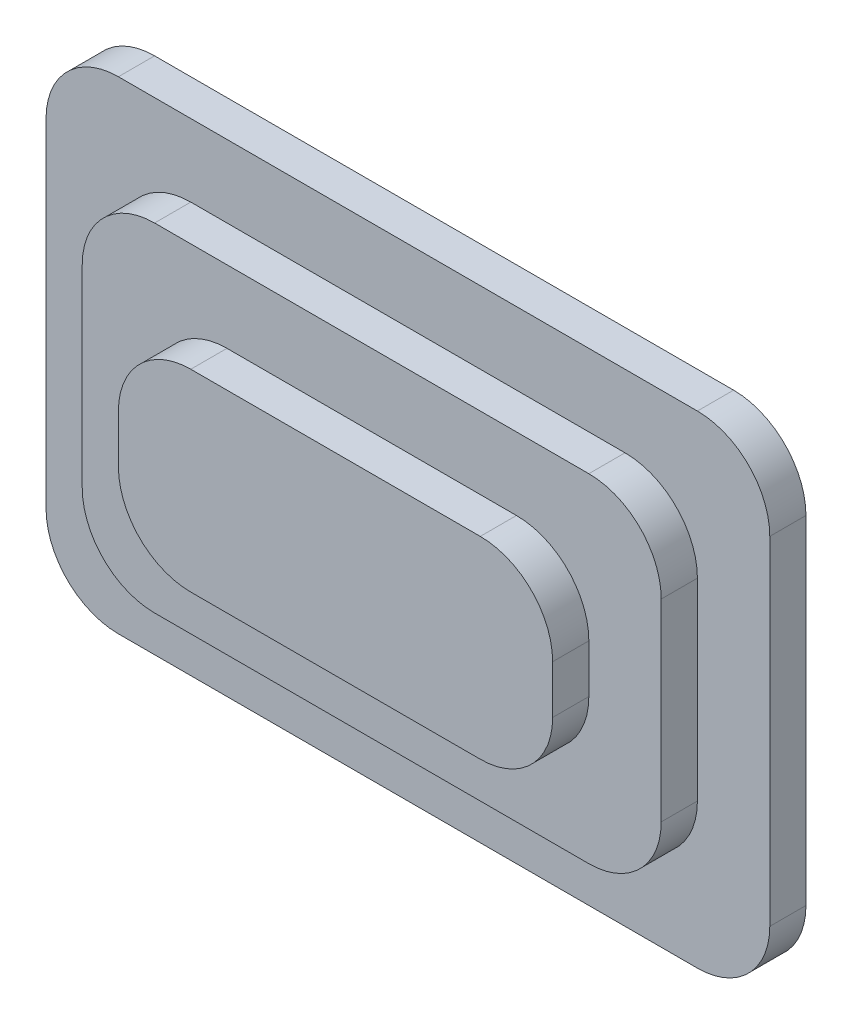
ISO-10303-21;
HEADER;
FILE_DESCRIPTION(('STEP AP214'),'2;1');
FILE_NAME('part.step','',(''),(''),'','','');
FILE_SCHEMA(('AUTOMOTIVE_DESIGN { 1 0 10303 214 1 1 1 1 }'));
ENDSEC;
DATA;
#1=APPLICATION_CONTEXT('core data for automotive mechanical design processes');
#2=APPLICATION_PROTOCOL_DEFINITION('international standard','automotive_design',2000,#1);
#3=PRODUCT_CONTEXT('',#1,'mechanical');
#4=PRODUCT('Part','Part','',(#3));
#5=PRODUCT_RELATED_PRODUCT_CATEGORY('part','',(#4));
#6=PRODUCT_DEFINITION_FORMATION('','',#4);
#7=PRODUCT_DEFINITION_CONTEXT('part definition',#1,'design');
#8=PRODUCT_DEFINITION('design','',#6,#7);
#9=PRODUCT_DEFINITION_SHAPE('','',#8);
#10=(LENGTH_UNIT() NAMED_UNIT(*) SI_UNIT(.MILLI.,.METRE.));
#11=(NAMED_UNIT(*) PLANE_ANGLE_UNIT() SI_UNIT($,.RADIAN.));
#12=(NAMED_UNIT(*) SI_UNIT($,.STERADIAN.) SOLID_ANGLE_UNIT());
#13=UNCERTAINTY_MEASURE_WITH_UNIT(LENGTH_MEASURE(1.E-05),#10,'distance_accuracy_value','');
#14=(GEOMETRIC_REPRESENTATION_CONTEXT(3) GLOBAL_UNCERTAINTY_ASSIGNED_CONTEXT((#13)) GLOBAL_UNIT_ASSIGNED_CONTEXT((#10,
#11,#12)) REPRESENTATION_CONTEXT('',''));
#15=CARTESIAN_POINT('',(0.,0.,0.));
#16=DIRECTION('',(0.,0.,1.));
#17=DIRECTION('',(1.,0.,0.));
#18=AXIS2_PLACEMENT_3D('',#15,#16,#17);
#19=CARTESIAN_POINT('',(375.,250.,13.4583428199529));
#20=DIRECTION('',(-1.,0.,0.));
#21=DIRECTION('',(0.,0.,1.));
#22=AXIS2_PLACEMENT_3D('',#19,#20,#21);
#23=PLANE('',#22);
#24=DIRECTION('',(0.,1.,0.));
#25=VECTOR('',#24,1.);
#26=CARTESIAN_POINT('',(375.,250.,-24.0416571800471));
#27=LINE('',#26,#25);
#28=CARTESIAN_POINT('',(375.,-175.,-24.0416571800471));
#29=VERTEX_POINT('',#28);
#30=CARTESIAN_POINT('',(375.,175.,-24.0416571800471));
#31=VERTEX_POINT('',#30);
#32=EDGE_CURVE('E270',#29,#31,#27,.T.);
#33=ORIENTED_EDGE('',*,*,#32,.T.);
#34=DIRECTION('',(0.,0.,-1.));
#35=VECTOR('',#34,1.);
#36=CARTESIAN_POINT('',(375.,175.,13.4583428199529));
#37=LINE('',#36,#35);
#38=CARTESIAN_POINT('',(375.,175.,13.4583428199529));
#39=VERTEX_POINT('',#38);
#40=EDGE_CURVE('E11',#31,#39,#37,.F.);
#41=ORIENTED_EDGE('',*,*,#40,.T.);
#42=DIRECTION('',(0.,1.,0.));
#43=VECTOR('',#42,1.);
#44=CARTESIAN_POINT('',(375.,250.,13.4583428199529));
#45=LINE('',#44,#43);
#46=CARTESIAN_POINT('',(375.,-175.,13.4583428199529));
#47=VERTEX_POINT('',#46);
#48=EDGE_CURVE('E287',#47,#39,#45,.T.);
#49=ORIENTED_EDGE('',*,*,#48,.F.);
#50=DIRECTION('',(0.,0.,-1.));
#51=VECTOR('',#50,1.);
#52=CARTESIAN_POINT('',(375.,-175.,13.4583428199529));
#53=LINE('',#52,#51);
#54=EDGE_CURVE('E52',#47,#29,#53,.T.);
#55=ORIENTED_EDGE('',*,*,#54,.T.);
#56=EDGE_LOOP('',(#33,#41,#49,#55));
#57=FACE_BOUND('',#56,.T.);
#58=ADVANCED_FACE('F43',(#57),#23,.F.);
#59=CARTESIAN_POINT('',(-375.,250.,13.4583428199529));
#60=DIRECTION('',(0.,-1.,0.));
#61=DIRECTION('',(0.,0.,-1.));
#62=AXIS2_PLACEMENT_3D('',#59,#60,#61);
#63=PLANE('',#62);
#64=DIRECTION('',(-1.,0.,0.));
#65=VECTOR('',#64,1.);
#66=CARTESIAN_POINT('',(-375.,250.,-24.0416571800471));
#67=LINE('',#66,#65);
#68=CARTESIAN_POINT('',(300.,250.,-24.0416571800471));
#69=VERTEX_POINT('',#68);
#70=CARTESIAN_POINT('',(-300.,250.,-24.0416571800471));
#71=VERTEX_POINT('',#70);
#72=EDGE_CURVE('E305',#69,#71,#67,.T.);
#73=ORIENTED_EDGE('',*,*,#72,.T.);
#74=DIRECTION('',(0.,0.,-1.));
#75=VECTOR('',#74,1.);
#76=CARTESIAN_POINT('',(-300.,250.,13.4583428199529));
#77=LINE('',#76,#75);
#78=CARTESIAN_POINT('',(-300.,250.,13.4583428199529));
#79=VERTEX_POINT('',#78);
#80=EDGE_CURVE('E59',#71,#79,#77,.F.);
#81=ORIENTED_EDGE('',*,*,#80,.T.);
#82=DIRECTION('',(-1.,0.,0.));
#83=VECTOR('',#82,1.);
#84=CARTESIAN_POINT('',(-375.,250.,13.4583428199529));
#85=LINE('',#84,#83);
#86=CARTESIAN_POINT('',(300.,250.,13.4583428199529));
#87=VERTEX_POINT('',#86);
#88=EDGE_CURVE('E290',#87,#79,#85,.T.);
#89=ORIENTED_EDGE('',*,*,#88,.F.);
#90=DIRECTION('',(0.,0.,-1.));
#91=VECTOR('',#90,1.);
#92=CARTESIAN_POINT('',(300.,250.,13.4583428199529));
#93=LINE('',#92,#91);
#94=EDGE_CURVE('E441',#87,#69,#93,.T.);
#95=ORIENTED_EDGE('',*,*,#94,.T.);
#96=EDGE_LOOP('',(#73,#81,#89,#95));
#97=FACE_BOUND('',#96,.T.);
#98=ADVANCED_FACE('F463',(#97),#63,.F.);
#99=CARTESIAN_POINT('',(-375.,250.,13.4583428199529));
#100=DIRECTION('',(1.,0.,0.));
#101=DIRECTION('',(0.,1.,0.));
#102=AXIS2_PLACEMENT_3D('',#99,#100,#101);
#103=PLANE('',#102);
#104=DIRECTION('',(0.,-1.,0.));
#105=VECTOR('',#104,1.);
#106=CARTESIAN_POINT('',(-375.,250.,-24.0416571800471));
#107=LINE('',#106,#105);
#108=CARTESIAN_POINT('',(-375.,175.,-24.0416571800471));
#109=VERTEX_POINT('',#108);
#110=CARTESIAN_POINT('',(-375.,-175.,-24.0416571800471));
#111=VERTEX_POINT('',#110);
#112=EDGE_CURVE('E308',#109,#111,#107,.T.);
#113=ORIENTED_EDGE('',*,*,#112,.T.);
#114=DIRECTION('',(0.,0.,-1.));
#115=VECTOR('',#114,1.);
#116=CARTESIAN_POINT('',(-375.,-175.,13.4583428199529));
#117=LINE('',#116,#115);
#118=CARTESIAN_POINT('',(-375.,-175.,13.4583428199529));
#119=VERTEX_POINT('',#118);
#120=EDGE_CURVE('E427',#111,#119,#117,.F.);
#121=ORIENTED_EDGE('',*,*,#120,.T.);
#122=DIRECTION('',(0.,-1.,0.));
#123=VECTOR('',#122,1.);
#124=CARTESIAN_POINT('',(-375.,250.,13.4583428199529));
#125=LINE('',#124,#123);
#126=CARTESIAN_POINT('',(-375.,175.,13.4583428199529));
#127=VERTEX_POINT('',#126);
#128=EDGE_CURVE('E294',#127,#119,#125,.T.);
#129=ORIENTED_EDGE('',*,*,#128,.F.);
#130=DIRECTION('',(0.,0.,-1.));
#131=VECTOR('',#130,1.);
#132=CARTESIAN_POINT('',(-375.,175.,13.4583428199529));
#133=LINE('',#132,#131);
#134=EDGE_CURVE('E423',#127,#109,#133,.T.);
#135=ORIENTED_EDGE('',*,*,#134,.T.);
#136=EDGE_LOOP('',(#113,#121,#129,#135));
#137=FACE_BOUND('',#136,.T.);
#138=ADVANCED_FACE('F472',(#137),#103,.F.);
#139=CARTESIAN_POINT('',(-375.,-250.,13.4583428199529));
#140=DIRECTION('',(0.,1.,0.));
#141=DIRECTION('',(0.,0.,1.));
#142=AXIS2_PLACEMENT_3D('',#139,#140,#141);
#143=PLANE('',#142);
#144=DIRECTION('',(1.,0.,0.));
#145=VECTOR('',#144,1.);
#146=CARTESIAN_POINT('',(-375.,-250.,13.4583428199529));
#147=LINE('',#146,#145);
#148=CARTESIAN_POINT('',(-300.,-250.,13.4583428199529));
#149=VERTEX_POINT('',#148);
#150=CARTESIAN_POINT('',(300.,-250.,13.4583428199529));
#151=VERTEX_POINT('',#150);
#152=EDGE_CURVE('E298',#149,#151,#147,.T.);
#153=ORIENTED_EDGE('',*,*,#152,.F.);
#154=DIRECTION('',(0.,0.,-1.));
#155=VECTOR('',#154,1.);
#156=CARTESIAN_POINT('',(-300.,-250.,13.4583428199529));
#157=LINE('',#156,#155);
#158=CARTESIAN_POINT('',(-300.,-250.,-24.0416571800471));
#159=VERTEX_POINT('',#158);
#160=EDGE_CURVE('E407',#149,#159,#157,.T.);
#161=ORIENTED_EDGE('',*,*,#160,.T.);
#162=DIRECTION('',(1.,0.,0.));
#163=VECTOR('',#162,1.);
#164=CARTESIAN_POINT('',(-375.,-250.,-24.0416571800471));
#165=LINE('',#164,#163);
#166=CARTESIAN_POINT('',(300.,-250.,-24.0416571800471));
#167=VERTEX_POINT('',#166);
#168=EDGE_CURVE('E291',#159,#167,#165,.T.);
#169=ORIENTED_EDGE('',*,*,#168,.T.);
#170=DIRECTION('',(0.,0.,-1.));
#171=VECTOR('',#170,1.);
#172=CARTESIAN_POINT('',(300.,-250.,13.4583428199529));
#173=LINE('',#172,#171);
#174=EDGE_CURVE('E404',#167,#151,#173,.F.);
#175=ORIENTED_EDGE('',*,*,#174,.T.);
#176=EDGE_LOOP('',(#153,#161,#169,#175));
#177=FACE_BOUND('',#176,.T.);
#178=ADVANCED_FACE('F480',(#177),#143,.F.);
#179=CARTESIAN_POINT('',(-3.78685664913888E-13,0.,13.4583428199529));
#180=DIRECTION('',(0.,0.,1.));
#181=DIRECTION('',(1.,0.,0.));
#182=AXIS2_PLACEMENT_3D('',#179,#180,#181);
#183=PLANE('',#182);
#184=DIRECTION('',(0.,-1.,0.));
#185=VECTOR('',#184,1.);
#186=CARTESIAN_POINT('',(-300.,175.,13.4583428199529));
#187=LINE('',#186,#185);
#188=CARTESIAN_POINT('',(-300.,100.,13.4583428199529));
#189=VERTEX_POINT('',#188);
#190=CARTESIAN_POINT('',(-300.,-100.,13.4583428199529));
#191=VERTEX_POINT('',#190);
#192=EDGE_CURVE('E271',#189,#191,#187,.T.);
#193=ORIENTED_EDGE('',*,*,#192,.F.);
#194=CARTESIAN_POINT('',(-225.,100.,13.4583428199529));
#195=DIRECTION('',(0.,0.,1.));
#196=DIRECTION('',(1.,0.,0.));
#197=AXIS2_PLACEMENT_3D('',#194,#195,#196);
#198=CIRCLE('',#197,75.);
#199=CARTESIAN_POINT('',(-225.,175.,13.4583428199529));
#200=VERTEX_POINT('',#199);
#201=EDGE_CURVE('E398',#189,#200,#198,.F.);
#202=ORIENTED_EDGE('',*,*,#201,.T.);
#203=DIRECTION('',(-1.,0.,0.));
#204=VECTOR('',#203,1.);
#205=CARTESIAN_POINT('',(300.,175.,13.4583428199529));
#206=LINE('',#205,#204);
#207=CARTESIAN_POINT('',(225.,175.,13.4583428199529));
#208=VERTEX_POINT('',#207);
#209=EDGE_CURVE('E258',#208,#200,#206,.T.);
#210=ORIENTED_EDGE('',*,*,#209,.F.);
#211=CARTESIAN_POINT('',(225.,100.,13.4583428199529));
#212=DIRECTION('',(0.,0.,1.));
#213=DIRECTION('',(1.,0.,0.));
#214=AXIS2_PLACEMENT_3D('',#211,#212,#213);
#215=CIRCLE('',#214,75.);
#216=CARTESIAN_POINT('',(300.,100.,13.4583428199529));
#217=VERTEX_POINT('',#216);
#218=EDGE_CURVE('E401',#208,#217,#215,.F.);
#219=ORIENTED_EDGE('',*,*,#218,.T.);
#220=DIRECTION('',(0.,1.,0.));
#221=VECTOR('',#220,1.);
#222=CARTESIAN_POINT('',(300.,-175.,13.4583428199529));
#223=LINE('',#222,#221);
#224=CARTESIAN_POINT('',(300.,-100.,13.4583428199529));
#225=VERTEX_POINT('',#224);
#226=EDGE_CURVE('E280',#225,#217,#223,.T.);
#227=ORIENTED_EDGE('',*,*,#226,.F.);
#228=CARTESIAN_POINT('',(225.,-100.,13.4583428199529));
#229=DIRECTION('',(0.,0.,1.));
#230=DIRECTION('',(1.,0.,0.));
#231=AXIS2_PLACEMENT_3D('',#228,#229,#230);
#232=CIRCLE('',#231,75.);
#233=CARTESIAN_POINT('',(225.,-175.,13.4583428199529));
#234=VERTEX_POINT('',#233);
#235=EDGE_CURVE('E392',#225,#234,#232,.F.);
#236=ORIENTED_EDGE('',*,*,#235,.T.);
#237=DIRECTION('',(1.,0.,0.));
#238=VECTOR('',#237,1.);
#239=CARTESIAN_POINT('',(-300.,-175.,13.4583428199529));
#240=LINE('',#239,#238);
#241=CARTESIAN_POINT('',(-225.,-175.,13.4583428199529));
#242=VERTEX_POINT('',#241);
#243=EDGE_CURVE('E275',#242,#234,#240,.T.);
#244=ORIENTED_EDGE('',*,*,#243,.F.);
#245=CARTESIAN_POINT('',(-225.,-100.,13.4583428199529));
#246=DIRECTION('',(0.,0.,1.));
#247=DIRECTION('',(1.,0.,0.));
#248=AXIS2_PLACEMENT_3D('',#245,#246,#247);
#249=CIRCLE('',#248,75.);
#250=EDGE_CURVE('E395',#242,#191,#249,.F.);
#251=ORIENTED_EDGE('',*,*,#250,.T.);
#252=EDGE_LOOP('',(#193,#202,#210,#219,#227,#236,#244,#251));
#253=FACE_BOUND('',#252,.T.);
#254=ORIENTED_EDGE('',*,*,#128,.T.);
#255=CARTESIAN_POINT('',(-300.,-175.,13.4583428199529));
#256=DIRECTION('',(0.,0.,1.));
#257=DIRECTION('',(1.,0.,0.));
#258=AXIS2_PLACEMENT_3D('',#255,#256,#257);
#259=CIRCLE('',#258,75.);
#260=EDGE_CURVE('E438',#119,#149,#259,.T.);
#261=ORIENTED_EDGE('',*,*,#260,.T.);
#262=ORIENTED_EDGE('',*,*,#152,.T.);
#263=CARTESIAN_POINT('',(300.,-175.,13.4583428199529));
#264=DIRECTION('',(0.,0.,1.));
#265=DIRECTION('',(1.,0.,0.));
#266=AXIS2_PLACEMENT_3D('',#263,#264,#265);
#267=CIRCLE('',#266,75.);
#268=EDGE_CURVE('E430',#151,#47,#267,.T.);
#269=ORIENTED_EDGE('',*,*,#268,.T.);
#270=ORIENTED_EDGE('',*,*,#48,.T.);
#271=CARTESIAN_POINT('',(300.,175.,13.4583428199529));
#272=DIRECTION('',(0.,0.,1.));
#273=DIRECTION('',(1.,0.,0.));
#274=AXIS2_PLACEMENT_3D('',#271,#272,#273);
#275=CIRCLE('',#274,75.);
#276=EDGE_CURVE('E66',#39,#87,#275,.T.);
#277=ORIENTED_EDGE('',*,*,#276,.T.);
#278=ORIENTED_EDGE('',*,*,#88,.T.);
#279=CARTESIAN_POINT('',(-300.,175.,13.4583428199529));
#280=DIRECTION('',(0.,0.,1.));
#281=DIRECTION('',(1.,0.,0.));
#282=AXIS2_PLACEMENT_3D('',#279,#280,#281);
#283=CIRCLE('',#282,75.);
#284=EDGE_CURVE('E435',#79,#127,#283,.T.);
#285=ORIENTED_EDGE('',*,*,#284,.T.);
#286=EDGE_LOOP('',(#254,#261,#262,#269,#270,#277,#278,#285));
#287=FACE_BOUND('',#286,.T.);
#288=ADVANCED_FACE('F465',(#253,#287),#183,.T.);
#289=CARTESIAN_POINT('',(-3.78685664913888E-13,0.,-24.0416571800471));
#290=DIRECTION('',(0.,0.,1.));
#291=DIRECTION('',(1.,0.,0.));
#292=AXIS2_PLACEMENT_3D('',#289,#290,#291);
#293=PLANE('',#292);
#294=ORIENTED_EDGE('',*,*,#168,.F.);
#295=CARTESIAN_POINT('',(-300.,-175.,-24.0416571800471));
#296=DIRECTION('',(0.,0.,1.));
#297=DIRECTION('',(1.,0.,0.));
#298=AXIS2_PLACEMENT_3D('',#295,#296,#297);
#299=CIRCLE('',#298,75.);
#300=EDGE_CURVE('E420',#159,#111,#299,.F.);
#301=ORIENTED_EDGE('',*,*,#300,.T.);
#302=ORIENTED_EDGE('',*,*,#112,.F.);
#303=CARTESIAN_POINT('',(-300.,175.,-24.0416571800471));
#304=DIRECTION('',(0.,0.,1.));
#305=DIRECTION('',(1.,0.,0.));
#306=AXIS2_PLACEMENT_3D('',#303,#304,#305);
#307=CIRCLE('',#306,75.);
#308=EDGE_CURVE('E417',#109,#71,#307,.F.);
#309=ORIENTED_EDGE('',*,*,#308,.T.);
#310=ORIENTED_EDGE('',*,*,#72,.F.);
#311=CARTESIAN_POINT('',(300.,175.,-24.0416571800471));
#312=DIRECTION('',(0.,0.,1.));
#313=DIRECTION('',(1.,0.,0.));
#314=AXIS2_PLACEMENT_3D('',#311,#312,#313);
#315=CIRCLE('',#314,75.);
#316=EDGE_CURVE('E414',#69,#31,#315,.F.);
#317=ORIENTED_EDGE('',*,*,#316,.T.);
#318=ORIENTED_EDGE('',*,*,#32,.F.);
#319=CARTESIAN_POINT('',(300.,-175.,-24.0416571800471));
#320=DIRECTION('',(0.,0.,1.));
#321=DIRECTION('',(1.,0.,0.));
#322=AXIS2_PLACEMENT_3D('',#319,#320,#321);
#323=CIRCLE('',#322,75.);
#324=EDGE_CURVE('E411',#29,#167,#323,.F.);
#325=ORIENTED_EDGE('',*,*,#324,.T.);
#326=EDGE_LOOP('',(#294,#301,#302,#309,#310,#317,#318,#325));
#327=FACE_BOUND('',#326,.T.);
#328=ADVANCED_FACE('F458',(#327),#293,.F.);
#329=CARTESIAN_POINT('',(-300.,175.,50.9583428199529));
#330=DIRECTION('',(1.,0.,0.));
#331=DIRECTION('',(0.,1.,0.));
#332=AXIS2_PLACEMENT_3D('',#329,#330,#331);
#333=PLANE('',#332);
#334=ORIENTED_EDGE('',*,*,#192,.T.);
#335=DIRECTION('',(0.,0.,-1.));
#336=VECTOR('',#335,1.);
#337=CARTESIAN_POINT('',(-300.,-100.,50.9583428199529));
#338=LINE('',#337,#336);
#339=CARTESIAN_POINT('',(-300.,-100.,50.9583428199529));
#340=VERTEX_POINT('',#339);
#341=EDGE_CURVE('E382',#191,#340,#338,.F.);
#342=ORIENTED_EDGE('',*,*,#341,.T.);
#343=DIRECTION('',(0.,-1.,0.));
#344=VECTOR('',#343,1.);
#345=CARTESIAN_POINT('',(-300.,175.,50.9583428199529));
#346=LINE('',#345,#344);
#347=CARTESIAN_POINT('',(-300.,100.,50.9583428199529));
#348=VERTEX_POINT('',#347);
#349=EDGE_CURVE('E253',#348,#340,#346,.T.);
#350=ORIENTED_EDGE('',*,*,#349,.F.);
#351=DIRECTION('',(0.,0.,-1.));
#352=VECTOR('',#351,1.);
#353=CARTESIAN_POINT('',(-300.,100.,50.9583428199529));
#354=LINE('',#353,#352);
#355=EDGE_CURVE('E378',#348,#189,#354,.T.);
#356=ORIENTED_EDGE('',*,*,#355,.T.);
#357=EDGE_LOOP('',(#334,#342,#350,#356));
#358=FACE_BOUND('',#357,.T.);
#359=ADVANCED_FACE('F684',(#358),#333,.F.);
#360=CARTESIAN_POINT('',(-300.,-175.,50.9583428199529));
#361=DIRECTION('',(0.,1.,0.));
#362=DIRECTION('',(0.,0.,1.));
#363=AXIS2_PLACEMENT_3D('',#360,#361,#362);
#364=PLANE('',#363);
#365=ORIENTED_EDGE('',*,*,#243,.T.);
#366=DIRECTION('',(0.,0.,-1.));
#367=VECTOR('',#366,1.);
#368=CARTESIAN_POINT('',(225.,-175.,50.9583428199529));
#369=LINE('',#368,#367);
#370=CARTESIAN_POINT('',(225.,-175.,50.9583428199529));
#371=VERTEX_POINT('',#370);
#372=EDGE_CURVE('E363',#234,#371,#369,.F.);
#373=ORIENTED_EDGE('',*,*,#372,.T.);
#374=DIRECTION('',(1.,0.,0.));
#375=VECTOR('',#374,1.);
#376=CARTESIAN_POINT('',(-300.,-175.,50.9583428199529));
#377=LINE('',#376,#375);
#378=CARTESIAN_POINT('',(-225.,-175.,50.9583428199529));
#379=VERTEX_POINT('',#378);
#380=EDGE_CURVE('E257',#379,#371,#377,.T.);
#381=ORIENTED_EDGE('',*,*,#380,.F.);
#382=DIRECTION('',(0.,0.,-1.));
#383=VECTOR('',#382,1.);
#384=CARTESIAN_POINT('',(-225.,-175.,50.9583428199529));
#385=LINE('',#384,#383);
#386=EDGE_CURVE('E359',#379,#242,#385,.T.);
#387=ORIENTED_EDGE('',*,*,#386,.T.);
#388=EDGE_LOOP('',(#365,#373,#381,#387));
#389=FACE_BOUND('',#388,.T.);
#390=ADVANCED_FACE('F674',(#389),#364,.F.);
#391=CARTESIAN_POINT('',(300.,-175.,50.9583428199529));
#392=DIRECTION('',(-1.,0.,0.));
#393=DIRECTION('',(0.,0.,1.));
#394=AXIS2_PLACEMENT_3D('',#391,#392,#393);
#395=PLANE('',#394);
#396=DIRECTION('',(0.,1.,0.));
#397=VECTOR('',#396,1.);
#398=CARTESIAN_POINT('',(300.,-175.,50.9583428199529));
#399=LINE('',#398,#397);
#400=CARTESIAN_POINT('',(300.,-100.,50.9583428199529));
#401=VERTEX_POINT('',#400);
#402=CARTESIAN_POINT('',(300.,100.,50.9583428199529));
#403=VERTEX_POINT('',#402);
#404=EDGE_CURVE('E262',#401,#403,#399,.T.);
#405=ORIENTED_EDGE('',*,*,#404,.F.);
#406=DIRECTION('',(0.,0.,-1.));
#407=VECTOR('',#406,1.);
#408=CARTESIAN_POINT('',(300.,-100.,50.9583428199529));
#409=LINE('',#408,#407);
#410=EDGE_CURVE('E355',#401,#225,#409,.T.);
#411=ORIENTED_EDGE('',*,*,#410,.T.);
#412=ORIENTED_EDGE('',*,*,#226,.T.);
#413=DIRECTION('',(0.,0.,-1.));
#414=VECTOR('',#413,1.);
#415=CARTESIAN_POINT('',(300.,100.,50.9583428199529));
#416=LINE('',#415,#414);
#417=EDGE_CURVE('E352',#217,#403,#416,.F.);
#418=ORIENTED_EDGE('',*,*,#417,.T.);
#419=EDGE_LOOP('',(#405,#411,#412,#418));
#420=FACE_BOUND('',#419,.T.);
#421=ADVANCED_FACE('F664',(#420),#395,.F.);
#422=CARTESIAN_POINT('',(300.,175.,50.9583428199529));
#423=DIRECTION('',(0.,-1.,0.));
#424=DIRECTION('',(0.,0.,-1.));
#425=AXIS2_PLACEMENT_3D('',#422,#423,#424);
#426=PLANE('',#425);
#427=ORIENTED_EDGE('',*,*,#209,.T.);
#428=DIRECTION('',(0.,0.,-1.));
#429=VECTOR('',#428,1.);
#430=CARTESIAN_POINT('',(-225.,175.,50.9583428199529));
#431=LINE('',#430,#429);
#432=CARTESIAN_POINT('',(-225.,175.,50.9583428199529));
#433=VERTEX_POINT('',#432);
#434=EDGE_CURVE('E389',#200,#433,#431,.F.);
#435=ORIENTED_EDGE('',*,*,#434,.T.);
#436=DIRECTION('',(-1.,0.,0.));
#437=VECTOR('',#436,1.);
#438=CARTESIAN_POINT('',(300.,175.,50.9583428199529));
#439=LINE('',#438,#437);
#440=CARTESIAN_POINT('',(225.,175.,50.9583428199529));
#441=VERTEX_POINT('',#440);
#442=EDGE_CURVE('E266',#441,#433,#439,.T.);
#443=ORIENTED_EDGE('',*,*,#442,.F.);
#444=DIRECTION('',(0.,0.,-1.));
#445=VECTOR('',#444,1.);
#446=CARTESIAN_POINT('',(225.,175.,50.9583428199529));
#447=LINE('',#446,#445);
#448=EDGE_CURVE('E385',#441,#208,#447,.T.);
#449=ORIENTED_EDGE('',*,*,#448,.T.);
#450=EDGE_LOOP('',(#427,#435,#443,#449));
#451=FACE_BOUND('',#450,.T.);
#452=ADVANCED_FACE('F655',(#451),#426,.F.);
#453=CARTESIAN_POINT('',(-3.78685664913888E-13,0.,50.9583428199529));
#454=DIRECTION('',(0.,0.,1.));
#455=DIRECTION('',(1.,0.,0.));
#456=AXIS2_PLACEMENT_3D('',#453,#454,#455);
#457=PLANE('',#456);
#458=DIRECTION('',(0.,-1.,0.));
#459=VECTOR('',#458,1.);
#460=CARTESIAN_POINT('',(-225.,100.,50.9583428199529));
#461=LINE('',#460,#459);
#462=CARTESIAN_POINT('',(-225.,25.0000000000002,50.9583428199529));
#463=VERTEX_POINT('',#462);
#464=CARTESIAN_POINT('',(-225.,-25.0000000000003,50.9583428199529));
#465=VERTEX_POINT('',#464);
#466=EDGE_CURVE('E249',#463,#465,#461,.T.);
#467=ORIENTED_EDGE('',*,*,#466,.F.);
#468=CARTESIAN_POINT('',(-150.,25.0000000000002,50.9583428199529));
#469=DIRECTION('',(0.,0.,1.));
#470=DIRECTION('',(1.,0.,0.));
#471=AXIS2_PLACEMENT_3D('',#468,#469,#470);
#472=CIRCLE('',#471,75.);
#473=CARTESIAN_POINT('',(-150.,100.,50.9583428199529));
#474=VERTEX_POINT('',#473);
#475=EDGE_CURVE('E348',#463,#474,#472,.F.);
#476=ORIENTED_EDGE('',*,*,#475,.T.);
#477=DIRECTION('',(-1.,0.,0.));
#478=VECTOR('',#477,1.);
#479=CARTESIAN_POINT('',(225.,100.,50.9583428199529));
#480=LINE('',#479,#478);
#481=CARTESIAN_POINT('',(150.,100.,50.9583428199529));
#482=VERTEX_POINT('',#481);
#483=EDGE_CURVE('E238',#482,#474,#480,.T.);
#484=ORIENTED_EDGE('',*,*,#483,.F.);
#485=CARTESIAN_POINT('',(150.,25.0000000000002,50.9583428199529));
#486=DIRECTION('',(0.,0.,1.));
#487=DIRECTION('',(1.,0.,0.));
#488=AXIS2_PLACEMENT_3D('',#485,#486,#487);
#489=CIRCLE('',#488,75.);
#490=CARTESIAN_POINT('',(225.,25.0000000000002,50.9583428199529));
#491=VERTEX_POINT('',#490);
#492=EDGE_CURVE('E236',#482,#491,#489,.F.);
#493=ORIENTED_EDGE('',*,*,#492,.T.);
#494=DIRECTION('',(0.,1.,0.));
#495=VECTOR('',#494,1.);
#496=CARTESIAN_POINT('',(225.,-100.,50.9583428199529));
#497=LINE('',#496,#495);
#498=CARTESIAN_POINT('',(225.,-25.0000000000002,50.9583428199529));
#499=VERTEX_POINT('',#498);
#500=EDGE_CURVE('E224',#499,#491,#497,.T.);
#501=ORIENTED_EDGE('',*,*,#500,.F.);
#502=CARTESIAN_POINT('',(150.,-25.0000000000002,50.9583428199529));
#503=DIRECTION('',(0.,0.,1.));
#504=DIRECTION('',(1.,0.,0.));
#505=AXIS2_PLACEMENT_3D('',#502,#503,#504);
#506=CIRCLE('',#505,75.);
#507=CARTESIAN_POINT('',(150.,-100.,50.9583428199529));
#508=VERTEX_POINT('',#507);
#509=EDGE_CURVE('E206',#499,#508,#506,.F.);
#510=ORIENTED_EDGE('',*,*,#509,.T.);
#511=DIRECTION('',(1.,0.,0.));
#512=VECTOR('',#511,1.);
#513=CARTESIAN_POINT('',(-225.,-100.,50.9583428199529));
#514=LINE('',#513,#512);
#515=CARTESIAN_POINT('',(-150.,-100.,50.9583428199529));
#516=VERTEX_POINT('',#515);
#517=EDGE_CURVE('E239',#516,#508,#514,.T.);
#518=ORIENTED_EDGE('',*,*,#517,.F.);
#519=CARTESIAN_POINT('',(-150.,-25.0000000000002,50.9583428199529));
#520=DIRECTION('',(0.,0.,1.));
#521=DIRECTION('',(1.,0.,0.));
#522=AXIS2_PLACEMENT_3D('',#519,#520,#521);
#523=CIRCLE('',#522,75.);
#524=EDGE_CURVE('E217',#516,#465,#523,.F.);
#525=ORIENTED_EDGE('',*,*,#524,.T.);
#526=EDGE_LOOP('',(#467,#476,#484,#493,#501,#510,#518,#525));
#527=FACE_BOUND('',#526,.T.);
#528=ORIENTED_EDGE('',*,*,#380,.T.);
#529=CARTESIAN_POINT('',(225.,-100.,50.9583428199529));
#530=DIRECTION('',(0.,0.,1.));
#531=DIRECTION('',(1.,0.,0.));
#532=AXIS2_PLACEMENT_3D('',#529,#530,#531);
#533=CIRCLE('',#532,75.);
#534=EDGE_CURVE('E375',#371,#401,#533,.T.);
#535=ORIENTED_EDGE('',*,*,#534,.T.);
#536=ORIENTED_EDGE('',*,*,#404,.T.);
#537=CARTESIAN_POINT('',(225.,100.,50.9583428199529));
#538=DIRECTION('',(0.,0.,1.));
#539=DIRECTION('',(1.,0.,0.));
#540=AXIS2_PLACEMENT_3D('',#537,#538,#539);
#541=CIRCLE('',#540,75.);
#542=EDGE_CURVE('E366',#403,#441,#541,.T.);
#543=ORIENTED_EDGE('',*,*,#542,.T.);
#544=ORIENTED_EDGE('',*,*,#442,.T.);
#545=CARTESIAN_POINT('',(-225.,100.,50.9583428199529));
#546=DIRECTION('',(0.,0.,1.));
#547=DIRECTION('',(1.,0.,0.));
#548=AXIS2_PLACEMENT_3D('',#545,#546,#547);
#549=CIRCLE('',#548,75.);
#550=EDGE_CURVE('E369',#433,#348,#549,.T.);
#551=ORIENTED_EDGE('',*,*,#550,.T.);
#552=ORIENTED_EDGE('',*,*,#349,.T.);
#553=CARTESIAN_POINT('',(-225.,-100.,50.9583428199529));
#554=DIRECTION('',(0.,0.,1.));
#555=DIRECTION('',(1.,0.,0.));
#556=AXIS2_PLACEMENT_3D('',#553,#554,#555);
#557=CIRCLE('',#556,75.);
#558=EDGE_CURVE('E372',#340,#379,#557,.T.);
#559=ORIENTED_EDGE('',*,*,#558,.T.);
#560=EDGE_LOOP('',(#528,#535,#536,#543,#544,#551,#552,#559));
#561=FACE_BOUND('',#560,.T.);
#562=ADVANCED_FACE('F233',(#527,#561),#457,.T.);
#563=CARTESIAN_POINT('',(-225.,100.,88.4583428199529));
#564=DIRECTION('',(1.,0.,0.));
#565=DIRECTION('',(0.,1.,0.));
#566=AXIS2_PLACEMENT_3D('',#563,#564,#565);
#567=PLANE('',#566);
#568=ORIENTED_EDGE('',*,*,#466,.T.);
#569=DIRECTION('',(0.,0.,-1.));
#570=VECTOR('',#569,1.);
#571=CARTESIAN_POINT('',(-225.,-25.0000000000003,88.4583428199529));
#572=LINE('',#571,#570);
#573=CARTESIAN_POINT('',(-225.,-25.0000000000003,88.4583428199529));
#574=VERTEX_POINT('',#573);
#575=EDGE_CURVE('E337',#465,#574,#572,.F.);
#576=ORIENTED_EDGE('',*,*,#575,.T.);
#577=DIRECTION('',(0.,-1.,0.));
#578=VECTOR('',#577,1.);
#579=CARTESIAN_POINT('',(-225.,100.,88.4583428199529));
#580=LINE('',#579,#578);
#581=CARTESIAN_POINT('',(-225.,25.0000000000002,88.4583428199529));
#582=VERTEX_POINT('',#581);
#583=EDGE_CURVE('E246',#582,#574,#580,.T.);
#584=ORIENTED_EDGE('',*,*,#583,.F.);
#585=DIRECTION('',(0.,0.,-1.));
#586=VECTOR('',#585,1.);
#587=CARTESIAN_POINT('',(-225.,25.0000000000002,88.4583428199529));
#588=LINE('',#587,#586);
#589=EDGE_CURVE('E334',#582,#463,#588,.T.);
#590=ORIENTED_EDGE('',*,*,#589,.T.);
#591=EDGE_LOOP('',(#568,#576,#584,#590));
#592=FACE_BOUND('',#591,.T.);
#593=ADVANCED_FACE('F636',(#592),#567,.F.);
#594=CARTESIAN_POINT('',(-225.,-100.,88.4583428199529));
#595=DIRECTION('',(0.,1.,0.));
#596=DIRECTION('',(0.,0.,1.));
#597=AXIS2_PLACEMENT_3D('',#594,#595,#596);
#598=PLANE('',#597);
#599=ORIENTED_EDGE('',*,*,#517,.T.);
#600=DIRECTION('',(0.,0.,-1.));
#601=VECTOR('',#600,1.);
#602=CARTESIAN_POINT('',(150.,-100.,88.4583428199529));
#603=LINE('',#602,#601);
#604=CARTESIAN_POINT('',(150.,-100.,88.4583428199529));
#605=VERTEX_POINT('',#604);
#606=EDGE_CURVE('E211',#508,#605,#603,.F.);
#607=ORIENTED_EDGE('',*,*,#606,.T.);
#608=DIRECTION('',(1.,0.,0.));
#609=VECTOR('',#608,1.);
#610=CARTESIAN_POINT('',(-225.,-100.,88.4583428199529));
#611=LINE('',#610,#609);
#612=CARTESIAN_POINT('',(-150.,-100.,88.4583428199529));
#613=VERTEX_POINT('',#612);
#614=EDGE_CURVE('E793',#613,#605,#611,.T.);
#615=ORIENTED_EDGE('',*,*,#614,.F.);
#616=DIRECTION('',(0.,0.,-1.));
#617=VECTOR('',#616,1.);
#618=CARTESIAN_POINT('',(-150.,-100.,88.4583428199529));
#619=LINE('',#618,#617);
#620=EDGE_CURVE('E229',#613,#516,#619,.T.);
#621=ORIENTED_EDGE('',*,*,#620,.T.);
#622=EDGE_LOOP('',(#599,#607,#615,#621));
#623=FACE_BOUND('',#622,.T.);
#624=ADVANCED_FACE('F627',(#623),#598,.F.);
#625=CARTESIAN_POINT('',(225.,-100.,88.4583428199529));
#626=DIRECTION('',(-1.,0.,0.));
#627=DIRECTION('',(0.,0.,1.));
#628=AXIS2_PLACEMENT_3D('',#625,#626,#627);
#629=PLANE('',#628);
#630=DIRECTION('',(0.,1.,0.));
#631=VECTOR('',#630,1.);
#632=CARTESIAN_POINT('',(225.,-100.,88.4583428199529));
#633=LINE('',#632,#631);
#634=CARTESIAN_POINT('',(225.,-25.0000000000002,88.4583428199529));
#635=VERTEX_POINT('',#634);
#636=CARTESIAN_POINT('',(225.,25.0000000000002,88.4583428199529));
#637=VERTEX_POINT('',#636);
#638=EDGE_CURVE('E227',#635,#637,#633,.T.);
#639=ORIENTED_EDGE('',*,*,#638,.F.);
#640=DIRECTION('',(0.,0.,-1.));
#641=VECTOR('',#640,1.);
#642=CARTESIAN_POINT('',(225.,-25.0000000000002,88.4583428199529));
#643=LINE('',#642,#641);
#644=EDGE_CURVE('E210',#635,#499,#643,.T.);
#645=ORIENTED_EDGE('',*,*,#644,.T.);
#646=ORIENTED_EDGE('',*,*,#500,.T.);
#647=DIRECTION('',(0.,0.,-1.));
#648=VECTOR('',#647,1.);
#649=CARTESIAN_POINT('',(225.,25.0000000000002,88.4583428199529));
#650=LINE('',#649,#648);
#651=EDGE_CURVE('E230',#491,#637,#650,.F.);
#652=ORIENTED_EDGE('',*,*,#651,.T.);
#653=EDGE_LOOP('',(#639,#645,#646,#652));
#654=FACE_BOUND('',#653,.T.);
#655=ADVANCED_FACE('F223',(#654),#629,.F.);
#656=CARTESIAN_POINT('',(225.,100.,88.4583428199529));
#657=DIRECTION('',(0.,-1.,0.));
#658=DIRECTION('',(0.,0.,-1.));
#659=AXIS2_PLACEMENT_3D('',#656,#657,#658);
#660=PLANE('',#659);
#661=ORIENTED_EDGE('',*,*,#483,.T.);
#662=DIRECTION('',(0.,0.,-1.));
#663=VECTOR('',#662,1.);
#664=CARTESIAN_POINT('',(-150.,100.,88.4583428199529));
#665=LINE('',#664,#663);
#666=CARTESIAN_POINT('',(-150.,100.,88.4583428199529));
#667=VERTEX_POINT('',#666);
#668=EDGE_CURVE('E218',#474,#667,#665,.F.);
#669=ORIENTED_EDGE('',*,*,#668,.T.);
#670=DIRECTION('',(-1.,0.,0.));
#671=VECTOR('',#670,1.);
#672=CARTESIAN_POINT('',(225.,100.,88.4583428199529));
#673=LINE('',#672,#671);
#674=CARTESIAN_POINT('',(150.,100.,88.4583428199529));
#675=VERTEX_POINT('',#674);
#676=EDGE_CURVE('E276',#675,#667,#673,.T.);
#677=ORIENTED_EDGE('',*,*,#676,.F.);
#678=DIRECTION('',(0.,0.,-1.));
#679=VECTOR('',#678,1.);
#680=CARTESIAN_POINT('',(150.,100.,88.4583428199529));
#681=LINE('',#680,#679);
#682=EDGE_CURVE('E340',#675,#482,#681,.T.);
#683=ORIENTED_EDGE('',*,*,#682,.T.);
#684=EDGE_LOOP('',(#661,#669,#677,#683));
#685=FACE_BOUND('',#684,.T.);
#686=ADVANCED_FACE('F608',(#685),#660,.F.);
#687=CARTESIAN_POINT('',(-3.78685664913888E-13,0.,88.4583428199529));
#688=DIRECTION('',(0.,0.,1.));
#689=DIRECTION('',(1.,0.,0.));
#690=AXIS2_PLACEMENT_3D('',#687,#688,#689);
#691=PLANE('',#690);
#692=ORIENTED_EDGE('',*,*,#614,.T.);
#693=CARTESIAN_POINT('',(150.,-25.0000000000002,88.4583428199529));
#694=DIRECTION('',(0.,0.,1.));
#695=DIRECTION('',(1.,0.,0.));
#696=AXIS2_PLACEMENT_3D('',#693,#694,#695);
#697=CIRCLE('',#696,75.);
#698=EDGE_CURVE('E331',#605,#635,#697,.T.);
#699=ORIENTED_EDGE('',*,*,#698,.T.);
#700=ORIENTED_EDGE('',*,*,#638,.T.);
#701=CARTESIAN_POINT('',(150.,25.0000000000002,88.4583428199529));
#702=DIRECTION('',(0.,0.,1.));
#703=DIRECTION('',(1.,0.,0.));
#704=AXIS2_PLACEMENT_3D('',#701,#702,#703);
#705=CIRCLE('',#704,75.);
#706=EDGE_CURVE('E322',#637,#675,#705,.T.);
#707=ORIENTED_EDGE('',*,*,#706,.T.);
#708=ORIENTED_EDGE('',*,*,#676,.T.);
#709=CARTESIAN_POINT('',(-150.,25.0000000000002,88.4583428199529));
#710=DIRECTION('',(0.,0.,1.));
#711=DIRECTION('',(1.,0.,0.));
#712=AXIS2_PLACEMENT_3D('',#709,#710,#711);
#713=CIRCLE('',#712,75.);
#714=EDGE_CURVE('E325',#667,#582,#713,.T.);
#715=ORIENTED_EDGE('',*,*,#714,.T.);
#716=ORIENTED_EDGE('',*,*,#583,.T.);
#717=CARTESIAN_POINT('',(-150.,-25.0000000000002,88.4583428199529));
#718=DIRECTION('',(0.,0.,1.));
#719=DIRECTION('',(1.,0.,0.));
#720=AXIS2_PLACEMENT_3D('',#717,#718,#719);
#721=CIRCLE('',#720,75.);
#722=EDGE_CURVE('E328',#574,#613,#721,.T.);
#723=ORIENTED_EDGE('',*,*,#722,.T.);
#724=EDGE_LOOP('',(#692,#699,#700,#707,#708,#715,#716,#723));
#725=FACE_BOUND('',#724,.T.);
#726=ADVANCED_FACE('F497',(#725),#691,.T.);
#727=CARTESIAN_POINT('',(150.,-25.0000000000002,88.4583428199529));
#728=DIRECTION('',(0.,0.,-1.));
#729=DIRECTION('',(-1.,0.,0.));
#730=AXIS2_PLACEMENT_3D('',#727,#728,#729);
#731=CYLINDRICAL_SURFACE('',#730,75.);
#732=ORIENTED_EDGE('',*,*,#698,.F.);
#733=ORIENTED_EDGE('',*,*,#606,.F.);
#734=ORIENTED_EDGE('',*,*,#509,.F.);
#735=ORIENTED_EDGE('',*,*,#644,.F.);
#736=EDGE_LOOP('',(#732,#733,#734,#735));
#737=FACE_BOUND('',#736,.T.);
#738=ADVANCED_FACE('F209',(#737),#731,.T.);
#739=CARTESIAN_POINT('',(-150.,-25.0000000000002,88.4583428199529));
#740=DIRECTION('',(0.,0.,-1.));
#741=DIRECTION('',(-1.,0.,0.));
#742=AXIS2_PLACEMENT_3D('',#739,#740,#741);
#743=CYLINDRICAL_SURFACE('',#742,75.);
#744=ORIENTED_EDGE('',*,*,#722,.F.);
#745=ORIENTED_EDGE('',*,*,#575,.F.);
#746=ORIENTED_EDGE('',*,*,#524,.F.);
#747=ORIENTED_EDGE('',*,*,#620,.F.);
#748=EDGE_LOOP('',(#744,#745,#746,#747));
#749=FACE_BOUND('',#748,.T.);
#750=ADVANCED_FACE('F496',(#749),#743,.T.);
#751=CARTESIAN_POINT('',(-150.,25.0000000000002,88.4583428199529));
#752=DIRECTION('',(0.,0.,-1.));
#753=DIRECTION('',(-1.,0.,0.));
#754=AXIS2_PLACEMENT_3D('',#751,#752,#753);
#755=CYLINDRICAL_SURFACE('',#754,75.);
#756=ORIENTED_EDGE('',*,*,#714,.F.);
#757=ORIENTED_EDGE('',*,*,#668,.F.);
#758=ORIENTED_EDGE('',*,*,#475,.F.);
#759=ORIENTED_EDGE('',*,*,#589,.F.);
#760=EDGE_LOOP('',(#756,#757,#758,#759));
#761=FACE_BOUND('',#760,.T.);
#762=ADVANCED_FACE('F500',(#761),#755,.T.);
#763=CARTESIAN_POINT('',(150.,25.0000000000002,88.4583428199529));
#764=DIRECTION('',(0.,0.,-1.));
#765=DIRECTION('',(-1.,0.,0.));
#766=AXIS2_PLACEMENT_3D('',#763,#764,#765);
#767=CYLINDRICAL_SURFACE('',#766,75.);
#768=ORIENTED_EDGE('',*,*,#706,.F.);
#769=ORIENTED_EDGE('',*,*,#651,.F.);
#770=ORIENTED_EDGE('',*,*,#492,.F.);
#771=ORIENTED_EDGE('',*,*,#682,.F.);
#772=EDGE_LOOP('',(#768,#769,#770,#771));
#773=FACE_BOUND('',#772,.T.);
#774=ADVANCED_FACE('F504',(#773),#767,.T.);
#775=CARTESIAN_POINT('',(225.,-100.,50.9583428199529));
#776=DIRECTION('',(0.,0.,-1.));
#777=DIRECTION('',(-1.,0.,0.));
#778=AXIS2_PLACEMENT_3D('',#775,#776,#777);
#779=CYLINDRICAL_SURFACE('',#778,75.);
#780=ORIENTED_EDGE('',*,*,#534,.F.);
#781=ORIENTED_EDGE('',*,*,#372,.F.);
#782=ORIENTED_EDGE('',*,*,#235,.F.);
#783=ORIENTED_EDGE('',*,*,#410,.F.);
#784=EDGE_LOOP('',(#780,#781,#782,#783));
#785=FACE_BOUND('',#784,.T.);
#786=ADVANCED_FACE('F508',(#785),#779,.T.);
#787=CARTESIAN_POINT('',(-225.,-100.,50.9583428199529));
#788=DIRECTION('',(0.,0.,-1.));
#789=DIRECTION('',(-1.,0.,0.));
#790=AXIS2_PLACEMENT_3D('',#787,#788,#789);
#791=CYLINDRICAL_SURFACE('',#790,75.);
#792=ORIENTED_EDGE('',*,*,#558,.F.);
#793=ORIENTED_EDGE('',*,*,#341,.F.);
#794=ORIENTED_EDGE('',*,*,#250,.F.);
#795=ORIENTED_EDGE('',*,*,#386,.F.);
#796=EDGE_LOOP('',(#792,#793,#794,#795));
#797=FACE_BOUND('',#796,.T.);
#798=ADVANCED_FACE('F512',(#797),#791,.T.);
#799=CARTESIAN_POINT('',(-225.,100.,50.9583428199529));
#800=DIRECTION('',(0.,0.,-1.));
#801=DIRECTION('',(-1.,0.,0.));
#802=AXIS2_PLACEMENT_3D('',#799,#800,#801);
#803=CYLINDRICAL_SURFACE('',#802,75.);
#804=ORIENTED_EDGE('',*,*,#550,.F.);
#805=ORIENTED_EDGE('',*,*,#434,.F.);
#806=ORIENTED_EDGE('',*,*,#201,.F.);
#807=ORIENTED_EDGE('',*,*,#355,.F.);
#808=EDGE_LOOP('',(#804,#805,#806,#807));
#809=FACE_BOUND('',#808,.T.);
#810=ADVANCED_FACE('F516',(#809),#803,.T.);
#811=CARTESIAN_POINT('',(225.,100.,50.9583428199529));
#812=DIRECTION('',(0.,0.,-1.));
#813=DIRECTION('',(-1.,0.,0.));
#814=AXIS2_PLACEMENT_3D('',#811,#812,#813);
#815=CYLINDRICAL_SURFACE('',#814,75.);
#816=ORIENTED_EDGE('',*,*,#542,.F.);
#817=ORIENTED_EDGE('',*,*,#417,.F.);
#818=ORIENTED_EDGE('',*,*,#218,.F.);
#819=ORIENTED_EDGE('',*,*,#448,.F.);
#820=EDGE_LOOP('',(#816,#817,#818,#819));
#821=FACE_BOUND('',#820,.T.);
#822=ADVANCED_FACE('F520',(#821),#815,.T.);
#823=CARTESIAN_POINT('',(-300.,-175.,13.4583428199529));
#824=DIRECTION('',(0.,0.,-1.));
#825=DIRECTION('',(-1.,0.,0.));
#826=AXIS2_PLACEMENT_3D('',#823,#824,#825);
#827=CYLINDRICAL_SURFACE('',#826,75.);
#828=ORIENTED_EDGE('',*,*,#260,.F.);
#829=ORIENTED_EDGE('',*,*,#120,.F.);
#830=ORIENTED_EDGE('',*,*,#300,.F.);
#831=ORIENTED_EDGE('',*,*,#160,.F.);
#832=EDGE_LOOP('',(#828,#829,#830,#831));
#833=FACE_BOUND('',#832,.T.);
#834=ADVANCED_FACE('F477',(#833),#827,.T.);
#835=CARTESIAN_POINT('',(-300.,175.,13.4583428199529));
#836=DIRECTION('',(0.,0.,-1.));
#837=DIRECTION('',(-1.,0.,0.));
#838=AXIS2_PLACEMENT_3D('',#835,#836,#837);
#839=CYLINDRICAL_SURFACE('',#838,75.);
#840=ORIENTED_EDGE('',*,*,#284,.F.);
#841=ORIENTED_EDGE('',*,*,#80,.F.);
#842=ORIENTED_EDGE('',*,*,#308,.F.);
#843=ORIENTED_EDGE('',*,*,#134,.F.);
#844=EDGE_LOOP('',(#840,#841,#842,#843));
#845=FACE_BOUND('',#844,.T.);
#846=ADVANCED_FACE('F469',(#845),#839,.T.);
#847=CARTESIAN_POINT('',(300.,175.,13.4583428199529));
#848=DIRECTION('',(0.,0.,-1.));
#849=DIRECTION('',(-1.,0.,0.));
#850=AXIS2_PLACEMENT_3D('',#847,#848,#849);
#851=CYLINDRICAL_SURFACE('',#850,75.);
#852=ORIENTED_EDGE('',*,*,#276,.F.);
#853=ORIENTED_EDGE('',*,*,#40,.F.);
#854=ORIENTED_EDGE('',*,*,#316,.F.);
#855=ORIENTED_EDGE('',*,*,#94,.F.);
#856=EDGE_LOOP('',(#852,#853,#854,#855));
#857=FACE_BOUND('',#856,.T.);
#858=ADVANCED_FACE('F462',(#857),#851,.T.);
#859=CARTESIAN_POINT('',(300.,-175.,13.4583428199529));
#860=DIRECTION('',(0.,0.,-1.));
#861=DIRECTION('',(-1.,0.,0.));
#862=AXIS2_PLACEMENT_3D('',#859,#860,#861);
#863=CYLINDRICAL_SURFACE('',#862,75.);
#864=ORIENTED_EDGE('',*,*,#268,.F.);
#865=ORIENTED_EDGE('',*,*,#174,.F.);
#866=ORIENTED_EDGE('',*,*,#324,.F.);
#867=ORIENTED_EDGE('',*,*,#54,.F.);
#868=EDGE_LOOP('',(#864,#865,#866,#867));
#869=FACE_BOUND('',#868,.T.);
#870=ADVANCED_FACE('F45',(#869),#863,.T.);
#871=CLOSED_SHELL('',(#58,#98,#138,#178,#288,#328,#359,#390,#421,#452,#562,#593,#624,#655,#686,
#726,#738,#750,#762,#774,#786,#798,#810,#822,#834,#846,#858,#870));
#872=MANIFOLD_SOLID_BREP('B2',#871);
#873=ADVANCED_BREP_SHAPE_REPRESENTATION('',(#18,#872),#14);
#874=SHAPE_DEFINITION_REPRESENTATION(#9,#873);
ENDSEC;
END-ISO-10303-21;
